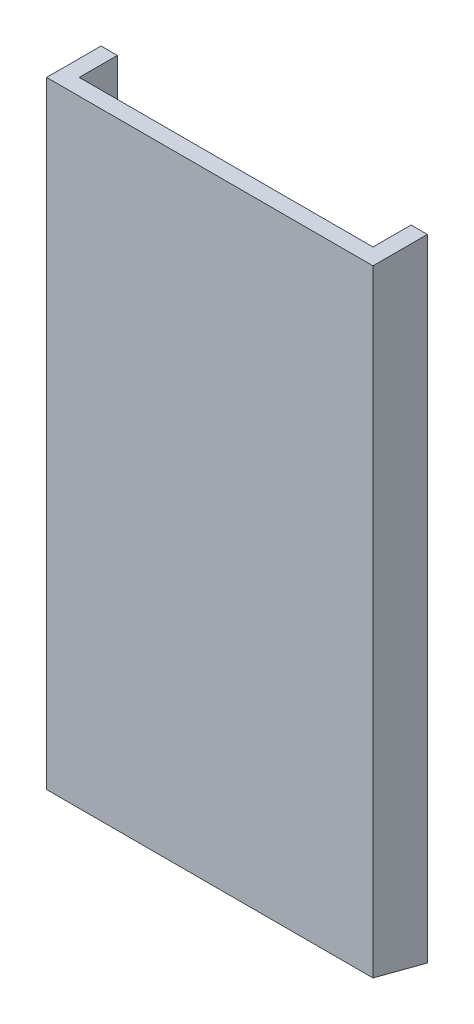
ISO-10303-21;
HEADER;
FILE_DESCRIPTION(('STEP AP214'),'2;1');
FILE_NAME('part.step','',(''),(''),'','','');
FILE_SCHEMA(('AUTOMOTIVE_DESIGN { 1 0 10303 214 1 1 1 1 }'));
ENDSEC;
DATA;
#1=APPLICATION_CONTEXT('core data for automotive mechanical design processes');
#2=APPLICATION_PROTOCOL_DEFINITION('international standard','automotive_design',2000,#1);
#3=PRODUCT_CONTEXT('',#1,'mechanical');
#4=PRODUCT('Part','Part','',(#3));
#5=PRODUCT_RELATED_PRODUCT_CATEGORY('part','',(#4));
#6=PRODUCT_DEFINITION_FORMATION('','',#4);
#7=PRODUCT_DEFINITION_CONTEXT('part definition',#1,'design');
#8=PRODUCT_DEFINITION('design','',#6,#7);
#9=PRODUCT_DEFINITION_SHAPE('','',#8);
#10=(LENGTH_UNIT() NAMED_UNIT(*) SI_UNIT(.MILLI.,.METRE.));
#11=(NAMED_UNIT(*) PLANE_ANGLE_UNIT() SI_UNIT($,.RADIAN.));
#12=(NAMED_UNIT(*) SI_UNIT($,.STERADIAN.) SOLID_ANGLE_UNIT());
#13=UNCERTAINTY_MEASURE_WITH_UNIT(LENGTH_MEASURE(1.E-05),#10,'distance_accuracy_value','');
#14=(GEOMETRIC_REPRESENTATION_CONTEXT(3) GLOBAL_UNCERTAINTY_ASSIGNED_CONTEXT((#13)) GLOBAL_UNIT_ASSIGNED_CONTEXT((#10,
#11,#12)) REPRESENTATION_CONTEXT('',''));
#15=CARTESIAN_POINT('',(0.,0.,0.));
#16=DIRECTION('',(0.,0.,1.));
#17=DIRECTION('',(1.,0.,0.));
#18=AXIS2_PLACEMENT_3D('',#15,#16,#17);
#19=CARTESIAN_POINT('',(-13.5,4.,-11.5));
#20=DIRECTION('',(-1.,0.,0.));
#21=DIRECTION('',(0.,0.,1.));
#22=AXIS2_PLACEMENT_3D('',#19,#20,#21);
#23=CYLINDRICAL_SURFACE('',#22,5.);
#24=CARTESIAN_POINT('',(-15.,4.,-11.5));
#25=DIRECTION('',(-1.,0.,0.));
#26=DIRECTION('',(0.,0.,1.));
#27=AXIS2_PLACEMENT_3D('',#24,#25,#26);
#28=CIRCLE('',#27,5.);
#29=CARTESIAN_POINT('',(-15.,8.63953921064893,-13.3640482592602));
#30=VERTEX_POINT('',#29);
#31=CARTESIAN_POINT('',(-15.,-1.,-11.5));
#32=VERTEX_POINT('',#31);
#33=EDGE_CURVE('E110',#30,#32,#28,.T.);
#34=ORIENTED_EDGE('',*,*,#33,.F.);
#35=DIRECTION('',(-1.,0.,0.));
#36=VECTOR('',#35,1.);
#37=CARTESIAN_POINT('',(-13.5,8.63953921064893,-13.3640482592602));
#38=LINE('',#37,#36);
#39=CARTESIAN_POINT('',(-13.5,8.63953921064893,-13.3640482592602));
#40=VERTEX_POINT('',#39);
#41=EDGE_CURVE('E12',#40,#30,#38,.T.);
#42=ORIENTED_EDGE('',*,*,#41,.F.);
#43=CARTESIAN_POINT('',(-13.5,4.,-11.5));
#44=DIRECTION('',(-1.,0.,0.));
#45=DIRECTION('',(0.,0.,1.));
#46=AXIS2_PLACEMENT_3D('',#43,#44,#45);
#47=CIRCLE('',#46,5.);
#48=CARTESIAN_POINT('',(-13.5,-1.,-11.5));
#49=VERTEX_POINT('',#48);
#50=EDGE_CURVE('E103',#40,#49,#47,.T.);
#51=ORIENTED_EDGE('',*,*,#50,.T.);
#52=DIRECTION('',(-1.,0.,0.));
#53=VECTOR('',#52,1.);
#54=CARTESIAN_POINT('',(-13.5,-1.,-11.5));
#55=LINE('',#54,#53);
#56=EDGE_CURVE('E48',#49,#32,#55,.T.);
#57=ORIENTED_EDGE('',*,*,#56,.T.);
#58=EDGE_LOOP('',(#34,#42,#51,#57));
#59=FACE_BOUND('',#58,.T.);
#60=ADVANCED_FACE('F45',(#59),#23,.T.);
#61=CARTESIAN_POINT('',(-13.5,12.,-5.));
#62=DIRECTION('',(0.,0.927907842129786,-0.372809651852045));
#63=DIRECTION('',(0.,0.372809651852045,0.927907842129787));
#64=AXIS2_PLACEMENT_3D('',#61,#62,#63);
#65=PLANE('',#64);
#66=DIRECTION('',(0.,-0.372809651852045,-0.927907842129787));
#67=VECTOR('',#66,1.);
#68=CARTESIAN_POINT('',(-15.,12.,-5.));
#69=LINE('',#68,#67);
#70=CARTESIAN_POINT('',(-15.,12.,-5.));
#71=VERTEX_POINT('',#70);
#72=EDGE_CURVE('E105',#71,#30,#69,.T.);
#73=ORIENTED_EDGE('',*,*,#72,.F.);
#74=DIRECTION('',(-1.,0.,0.));
#75=VECTOR('',#74,1.);
#76=CARTESIAN_POINT('',(-13.5,12.,-5.));
#77=LINE('',#76,#75);
#78=CARTESIAN_POINT('',(-13.5,12.,-5.));
#79=VERTEX_POINT('',#78);
#80=EDGE_CURVE('E54',#79,#71,#77,.T.);
#81=ORIENTED_EDGE('',*,*,#80,.F.);
#82=DIRECTION('',(0.,-0.372809651852045,-0.927907842129787));
#83=VECTOR('',#82,1.);
#84=CARTESIAN_POINT('',(-13.5,12.,-5.));
#85=LINE('',#84,#83);
#86=EDGE_CURVE('E100',#79,#40,#85,.T.);
#87=ORIENTED_EDGE('',*,*,#86,.T.);
#88=ORIENTED_EDGE('',*,*,#41,.T.);
#89=EDGE_LOOP('',(#73,#81,#87,#88));
#90=FACE_BOUND('',#89,.T.);
#91=ADVANCED_FACE('F121',(#90),#65,.T.);
#92=CARTESIAN_POINT('',(-13.5,12.,-5.));
#93=DIRECTION('',(0.,0.,1.));
#94=DIRECTION('',(0.,-1.,0.));
#95=AXIS2_PLACEMENT_3D('',#92,#93,#94);
#96=PLANE('',#95);
#97=DIRECTION('',(0.,1.,0.));
#98=VECTOR('',#97,1.);
#99=CARTESIAN_POINT('',(-15.,12.,-5.));
#100=LINE('',#99,#98);
#101=CARTESIAN_POINT('',(-15.,0.,-5.));
#102=VERTEX_POINT('',#101);
#103=EDGE_CURVE('E95',#102,#71,#100,.T.);
#104=ORIENTED_EDGE('',*,*,#103,.F.);
#105=DIRECTION('',(-1.,0.,0.));
#106=VECTOR('',#105,1.);
#107=CARTESIAN_POINT('',(-13.5,0.,-5.));
#108=LINE('',#107,#106);
#109=CARTESIAN_POINT('',(-13.5,0.,-5.));
#110=VERTEX_POINT('',#109);
#111=EDGE_CURVE('E90',#110,#102,#108,.T.);
#112=ORIENTED_EDGE('',*,*,#111,.F.);
#113=DIRECTION('',(0.,1.,0.));
#114=VECTOR('',#113,1.);
#115=CARTESIAN_POINT('',(-13.5,12.,-5.));
#116=LINE('',#115,#114);
#117=EDGE_CURVE('E93',#110,#79,#116,.T.);
#118=ORIENTED_EDGE('',*,*,#117,.T.);
#119=ORIENTED_EDGE('',*,*,#80,.T.);
#120=EDGE_LOOP('',(#104,#112,#118,#119));
#121=FACE_BOUND('',#120,.T.);
#122=ADVANCED_FACE('F92',(#121),#96,.T.);
#123=CARTESIAN_POINT('',(-13.5,-1.,-11.5));
#124=DIRECTION('',(0.,-0.988371697650617,0.152057184253941));
#125=DIRECTION('',(0.,-0.152057184253941,-0.988371697650617));
#126=AXIS2_PLACEMENT_3D('',#123,#124,#125);
#127=PLANE('',#126);
#128=DIRECTION('',(0.,0.152057184253941,0.988371697650617));
#129=VECTOR('',#128,1.);
#130=CARTESIAN_POINT('',(-15.,-1.,-11.5));
#131=LINE('',#130,#129);
#132=EDGE_CURVE('E113',#32,#102,#131,.T.);
#133=ORIENTED_EDGE('',*,*,#132,.F.);
#134=ORIENTED_EDGE('',*,*,#56,.F.);
#135=DIRECTION('',(0.,0.152057184253941,0.988371697650617));
#136=VECTOR('',#135,1.);
#137=CARTESIAN_POINT('',(-13.5,-1.,-11.5));
#138=LINE('',#137,#136);
#139=EDGE_CURVE('E99',#49,#110,#138,.T.);
#140=ORIENTED_EDGE('',*,*,#139,.T.);
#141=ORIENTED_EDGE('',*,*,#111,.T.);
#142=EDGE_LOOP('',(#133,#134,#140,#141));
#143=FACE_BOUND('',#142,.T.);
#144=ADVANCED_FACE('F102',(#143),#127,.T.);
#145=CARTESIAN_POINT('',(-13.5,4.,-11.5));
#146=DIRECTION('',(-1.,0.,0.));
#147=DIRECTION('',(0.,0.,1.));
#148=AXIS2_PLACEMENT_3D('',#145,#146,#147);
#149=PLANE('',#148);
#150=CARTESIAN_POINT('',(-13.5,4.,-11.5));
#151=DIRECTION('',(1.,0.,0.));
#152=DIRECTION('',(0.,0.,-1.));
#153=AXIS2_PLACEMENT_3D('',#150,#151,#152);
#154=CIRCLE('',#153,1.55);
#155=CARTESIAN_POINT('',(-13.5,4.,-13.05));
#156=VERTEX_POINT('',#155);
#157=EDGE_CURVE('E151',#156,#156,#154,.T.);
#158=ORIENTED_EDGE('',*,*,#157,.F.);
#159=EDGE_LOOP('',(#158));
#160=FACE_BOUND('',#159,.T.);
#161=ORIENTED_EDGE('',*,*,#50,.F.);
#162=ORIENTED_EDGE('',*,*,#86,.F.);
#163=ORIENTED_EDGE('',*,*,#117,.F.);
#164=ORIENTED_EDGE('',*,*,#139,.F.);
#165=EDGE_LOOP('',(#161,#162,#163,#164));
#166=FACE_BOUND('',#165,.T.);
#167=ADVANCED_FACE('F98',(#160,#166),#149,.F.);
#168=CARTESIAN_POINT('',(-15.,4.,-11.5));
#169=DIRECTION('',(-1.,0.,0.));
#170=DIRECTION('',(0.,0.,1.));
#171=AXIS2_PLACEMENT_3D('',#168,#169,#170);
#172=PLANE('',#171);
#173=CARTESIAN_POINT('',(-15.,4.,-11.5));
#174=DIRECTION('',(1.,0.,0.));
#175=DIRECTION('',(0.,0.,-1.));
#176=AXIS2_PLACEMENT_3D('',#173,#174,#175);
#177=CIRCLE('',#176,1.55);
#178=CARTESIAN_POINT('',(-15.,4.,-13.05));
#179=VERTEX_POINT('',#178);
#180=EDGE_CURVE('E114',#179,#179,#177,.T.);
#181=ORIENTED_EDGE('',*,*,#180,.T.);
#182=EDGE_LOOP('',(#181));
#183=FACE_BOUND('',#182,.T.);
#184=ORIENTED_EDGE('',*,*,#33,.T.);
#185=ORIENTED_EDGE('',*,*,#132,.T.);
#186=ORIENTED_EDGE('',*,*,#103,.T.);
#187=ORIENTED_EDGE('',*,*,#72,.T.);
#188=EDGE_LOOP('',(#184,#185,#186,#187));
#189=FACE_BOUND('',#188,.T.);
#190=ADVANCED_FACE('F120',(#183,#189),#172,.T.);
#191=CARTESIAN_POINT('',(-15.,4.,-11.5));
#192=DIRECTION('',(1.,0.,0.));
#193=DIRECTION('',(0.,0.,-1.));
#194=AXIS2_PLACEMENT_3D('',#191,#192,#193);
#195=CYLINDRICAL_SURFACE('',#194,1.55);
#196=ORIENTED_EDGE('',*,*,#180,.F.);
#197=EDGE_LOOP('',(#196));
#198=FACE_BOUND('',#197,.T.);
#199=ORIENTED_EDGE('',*,*,#157,.T.);
#200=EDGE_LOOP('',(#199));
#201=FACE_BOUND('',#200,.T.);
#202=ADVANCED_FACE('F139',(#198,#201),#195,.F.);
#203=CLOSED_SHELL('',(#60,#91,#122,#144,#167,#190,#202));
#204=MANIFOLD_SOLID_BREP('B2',#203);
#205=CARTESIAN_POINT('',(-15.,58.,-5.));
#206=DIRECTION('',(1.,0.,0.));
#207=DIRECTION('',(0.,0.,-1.));
#208=AXIS2_PLACEMENT_3D('',#205,#206,#207);
#209=PLANE('',#208);
#210=DIRECTION('',(0.,-1.,0.));
#211=VECTOR('',#210,1.);
#212=CARTESIAN_POINT('',(-15.,58.,-5.));
#213=LINE('',#212,#211);
#214=CARTESIAN_POINT('',(-15.,58.,-5.));
#215=VERTEX_POINT('',#214);
#216=CARTESIAN_POINT('',(-15.,0.,-5.));
#217=VERTEX_POINT('',#216);
#218=EDGE_CURVE('E287',#215,#217,#213,.T.);
#219=ORIENTED_EDGE('',*,*,#218,.T.);
#220=DIRECTION('',(0.,-0.252556606273089,-0.967582120870275));
#221=VECTOR('',#220,1.);
#222=CARTESIAN_POINT('',(-15.,0.,-5.));
#223=LINE('',#222,#221);
#224=CARTESIAN_POINT('',(-15.,1.30509132416549,0.));
#225=VERTEX_POINT('',#224);
#226=EDGE_CURVE('E261',#225,#217,#223,.T.);
#227=ORIENTED_EDGE('',*,*,#226,.F.);
#228=DIRECTION('',(0.,-1.,0.));
#229=VECTOR('',#228,1.);
#230=CARTESIAN_POINT('',(-15.,58.,0.));
#231=LINE('',#230,#229);
#232=CARTESIAN_POINT('',(-15.,58.,0.));
#233=VERTEX_POINT('',#232);
#234=EDGE_CURVE('E43',#233,#225,#231,.T.);
#235=ORIENTED_EDGE('',*,*,#234,.F.);
#236=DIRECTION('',(0.,0.,1.));
#237=VECTOR('',#236,1.);
#238=CARTESIAN_POINT('',(-15.,58.,-5.));
#239=LINE('',#238,#237);
#240=EDGE_CURVE('E293',#215,#233,#239,.T.);
#241=ORIENTED_EDGE('',*,*,#240,.F.);
#242=EDGE_LOOP('',(#219,#227,#235,#241));
#243=FACE_BOUND('',#242,.T.);
#244=ADVANCED_FACE('F190',(#243),#209,.F.);
#245=CARTESIAN_POINT('',(-15.,58.,0.));
#246=DIRECTION('',(0.,0.,-1.));
#247=DIRECTION('',(-1.,0.,0.));
#248=AXIS2_PLACEMENT_3D('',#245,#246,#247);
#249=PLANE('',#248);
#250=ORIENTED_EDGE('',*,*,#234,.T.);
#251=DIRECTION('',(-1.,0.,0.));
#252=VECTOR('',#251,1.);
#253=CARTESIAN_POINT('',(15.,1.30509132416549,0.));
#254=LINE('',#253,#252);
#255=CARTESIAN_POINT('',(15.,1.30509132416549,0.));
#256=VERTEX_POINT('',#255);
#257=EDGE_CURVE('E253',#256,#225,#254,.T.);
#258=ORIENTED_EDGE('',*,*,#257,.F.);
#259=DIRECTION('',(0.,-1.,0.));
#260=VECTOR('',#259,1.);
#261=CARTESIAN_POINT('',(15.,58.,0.));
#262=LINE('',#261,#260);
#263=CARTESIAN_POINT('',(15.,58.,0.));
#264=VERTEX_POINT('',#263);
#265=EDGE_CURVE('E198',#264,#256,#262,.T.);
#266=ORIENTED_EDGE('',*,*,#265,.F.);
#267=DIRECTION('',(1.,0.,0.));
#268=VECTOR('',#267,1.);
#269=CARTESIAN_POINT('',(-15.,58.,0.));
#270=LINE('',#269,#268);
#271=EDGE_CURVE('E306',#233,#264,#270,.T.);
#272=ORIENTED_EDGE('',*,*,#271,.F.);
#273=EDGE_LOOP('',(#250,#258,#266,#272));
#274=FACE_BOUND('',#273,.T.);
#275=ADVANCED_FACE('F265',(#274),#249,.F.);
#276=CARTESIAN_POINT('',(15.,58.,0.));
#277=DIRECTION('',(-1.,0.,0.));
#278=DIRECTION('',(0.,0.,1.));
#279=AXIS2_PLACEMENT_3D('',#276,#277,#278);
#280=PLANE('',#279);
#281=ORIENTED_EDGE('',*,*,#265,.T.);
#282=DIRECTION('',(0.,-0.252556606273089,-0.967582120870275));
#283=VECTOR('',#282,1.);
#284=CARTESIAN_POINT('',(15.,0.,-5.));
#285=LINE('',#284,#283);
#286=CARTESIAN_POINT('',(15.,0.,-5.));
#287=VERTEX_POINT('',#286);
#288=EDGE_CURVE('E249',#256,#287,#285,.T.);
#289=ORIENTED_EDGE('',*,*,#288,.T.);
#290=DIRECTION('',(0.,-1.,0.));
#291=VECTOR('',#290,1.);
#292=CARTESIAN_POINT('',(15.,58.,-5.));
#293=LINE('',#292,#291);
#294=CARTESIAN_POINT('',(15.,58.,-5.));
#295=VERTEX_POINT('',#294);
#296=EDGE_CURVE('E272',#295,#287,#293,.T.);
#297=ORIENTED_EDGE('',*,*,#296,.F.);
#298=DIRECTION('',(0.,0.,-1.));
#299=VECTOR('',#298,1.);
#300=CARTESIAN_POINT('',(15.,58.,0.));
#301=LINE('',#300,#299);
#302=EDGE_CURVE('E271',#264,#295,#301,.T.);
#303=ORIENTED_EDGE('',*,*,#302,.F.);
#304=EDGE_LOOP('',(#281,#289,#297,#303));
#305=FACE_BOUND('',#304,.T.);
#306=ADVANCED_FACE('F270',(#305),#280,.F.);
#307=CARTESIAN_POINT('',(13.5,58.,-5.));
#308=DIRECTION('',(0.,0.,1.));
#309=DIRECTION('',(1.,0.,0.));
#310=AXIS2_PLACEMENT_3D('',#307,#308,#309);
#311=PLANE('',#310);
#312=DIRECTION('',(-1.,0.,0.));
#313=VECTOR('',#312,1.);
#314=CARTESIAN_POINT('',(13.5,0.,-5.));
#315=LINE('',#314,#313);
#316=CARTESIAN_POINT('',(13.5,0.,-5.));
#317=VERTEX_POINT('',#316);
#318=EDGE_CURVE('E256',#287,#317,#315,.T.);
#319=ORIENTED_EDGE('',*,*,#318,.T.);
#320=DIRECTION('',(0.,-1.,0.));
#321=VECTOR('',#320,1.);
#322=CARTESIAN_POINT('',(13.5,58.,-5.));
#323=LINE('',#322,#321);
#324=CARTESIAN_POINT('',(13.5,58.,-5.));
#325=VERTEX_POINT('',#324);
#326=EDGE_CURVE('E273',#325,#317,#323,.T.);
#327=ORIENTED_EDGE('',*,*,#326,.F.);
#328=DIRECTION('',(-1.,0.,0.));
#329=VECTOR('',#328,1.);
#330=CARTESIAN_POINT('',(13.5,58.,-5.));
#331=LINE('',#330,#329);
#332=EDGE_CURVE('E303',#295,#325,#331,.T.);
#333=ORIENTED_EDGE('',*,*,#332,.F.);
#334=ORIENTED_EDGE('',*,*,#296,.T.);
#335=EDGE_LOOP('',(#319,#327,#333,#334));
#336=FACE_BOUND('',#335,.T.);
#337=ADVANCED_FACE('F325',(#336),#311,.F.);
#338=CARTESIAN_POINT('',(13.5,58.,-5.));
#339=DIRECTION('',(1.,0.,0.));
#340=DIRECTION('',(0.,0.,-1.));
#341=AXIS2_PLACEMENT_3D('',#338,#339,#340);
#342=PLANE('',#341);
#343=ORIENTED_EDGE('',*,*,#326,.T.);
#344=DIRECTION('',(0.,0.252556606273089,0.967582120870275));
#345=VECTOR('',#344,1.);
#346=CARTESIAN_POINT('',(13.5,3.69952068358645,9.17341689077584));
#347=LINE('',#346,#345);
#348=CARTESIAN_POINT('',(13.5,0.913563926915842,-1.5));
#349=VERTEX_POINT('',#348);
#350=EDGE_CURVE('E295',#317,#349,#347,.T.);
#351=ORIENTED_EDGE('',*,*,#350,.T.);
#352=DIRECTION('',(0.,-1.,0.));
#353=VECTOR('',#352,1.);
#354=CARTESIAN_POINT('',(13.5,58.,-1.5));
#355=LINE('',#354,#353);
#356=CARTESIAN_POINT('',(13.5,58.,-1.5));
#357=VERTEX_POINT('',#356);
#358=EDGE_CURVE('E278',#357,#349,#355,.T.);
#359=ORIENTED_EDGE('',*,*,#358,.F.);
#360=DIRECTION('',(0.,0.,1.));
#361=VECTOR('',#360,1.);
#362=CARTESIAN_POINT('',(13.5,58.,-5.));
#363=LINE('',#362,#361);
#364=EDGE_CURVE('E301',#325,#357,#363,.T.);
#365=ORIENTED_EDGE('',*,*,#364,.F.);
#366=EDGE_LOOP('',(#343,#351,#359,#365));
#367=FACE_BOUND('',#366,.T.);
#368=ADVANCED_FACE('F329',(#367),#342,.F.);
#369=CARTESIAN_POINT('',(13.5,58.,-1.5));
#370=DIRECTION('',(0.,0.,1.));
#371=DIRECTION('',(1.,0.,0.));
#372=AXIS2_PLACEMENT_3D('',#369,#370,#371);
#373=PLANE('',#372);
#374=ORIENTED_EDGE('',*,*,#358,.T.);
#375=DIRECTION('',(-1.,0.,0.));
#376=VECTOR('',#375,1.);
#377=CARTESIAN_POINT('',(13.5,0.913563926915842,-1.5));
#378=LINE('',#377,#376);
#379=CARTESIAN_POINT('',(-13.5,0.913563926915851,-1.5));
#380=VERTEX_POINT('',#379);
#381=EDGE_CURVE('E311',#349,#380,#378,.T.);
#382=ORIENTED_EDGE('',*,*,#381,.T.);
#383=DIRECTION('',(0.,-1.,0.));
#384=VECTOR('',#383,1.);
#385=CARTESIAN_POINT('',(-13.5,58.,-1.5));
#386=LINE('',#385,#384);
#387=CARTESIAN_POINT('',(-13.5,58.,-1.5));
#388=VERTEX_POINT('',#387);
#389=EDGE_CURVE('E281',#388,#380,#386,.T.);
#390=ORIENTED_EDGE('',*,*,#389,.F.);
#391=DIRECTION('',(-1.,0.,0.));
#392=VECTOR('',#391,1.);
#393=CARTESIAN_POINT('',(13.5,58.,-1.5));
#394=LINE('',#393,#392);
#395=EDGE_CURVE('E299',#357,#388,#394,.T.);
#396=ORIENTED_EDGE('',*,*,#395,.F.);
#397=EDGE_LOOP('',(#374,#382,#390,#396));
#398=FACE_BOUND('',#397,.T.);
#399=ADVANCED_FACE('F334',(#398),#373,.F.);
#400=CARTESIAN_POINT('',(-13.5,58.,-1.5));
#401=DIRECTION('',(-1.,0.,0.));
#402=DIRECTION('',(0.,0.,1.));
#403=AXIS2_PLACEMENT_3D('',#400,#401,#402);
#404=PLANE('',#403);
#405=ORIENTED_EDGE('',*,*,#389,.T.);
#406=DIRECTION('',(0.,-0.252556606273089,-0.967582120870275));
#407=VECTOR('',#406,1.);
#408=CARTESIAN_POINT('',(-13.5,4.55481308216775,12.4501699529732));
#409=LINE('',#408,#407);
#410=CARTESIAN_POINT('',(-13.5,0.,-5.));
#411=VERTEX_POINT('',#410);
#412=EDGE_CURVE('E268',#380,#411,#409,.T.);
#413=ORIENTED_EDGE('',*,*,#412,.T.);
#414=DIRECTION('',(0.,-1.,0.));
#415=VECTOR('',#414,1.);
#416=CARTESIAN_POINT('',(-13.5,58.,-5.));
#417=LINE('',#416,#415);
#418=CARTESIAN_POINT('',(-13.5,58.,-5.));
#419=VERTEX_POINT('',#418);
#420=EDGE_CURVE('E284',#419,#411,#417,.T.);
#421=ORIENTED_EDGE('',*,*,#420,.F.);
#422=DIRECTION('',(0.,0.,-1.));
#423=VECTOR('',#422,1.);
#424=CARTESIAN_POINT('',(-13.5,58.,-1.5));
#425=LINE('',#424,#423);
#426=EDGE_CURVE('E297',#388,#419,#425,.T.);
#427=ORIENTED_EDGE('',*,*,#426,.F.);
#428=EDGE_LOOP('',(#405,#413,#421,#427));
#429=FACE_BOUND('',#428,.T.);
#430=ADVANCED_FACE('F336',(#429),#404,.F.);
#431=CARTESIAN_POINT('',(-13.5,58.,-5.));
#432=DIRECTION('',(0.,0.,1.));
#433=DIRECTION('',(1.,0.,0.));
#434=AXIS2_PLACEMENT_3D('',#431,#432,#433);
#435=PLANE('',#434);
#436=DIRECTION('',(-1.,0.,0.));
#437=VECTOR('',#436,1.);
#438=CARTESIAN_POINT('',(-13.5,0.,-5.));
#439=LINE('',#438,#437);
#440=EDGE_CURVE('E290',#411,#217,#439,.T.);
#441=ORIENTED_EDGE('',*,*,#440,.T.);
#442=ORIENTED_EDGE('',*,*,#218,.F.);
#443=DIRECTION('',(-1.,0.,0.));
#444=VECTOR('',#443,1.);
#445=CARTESIAN_POINT('',(-13.5,58.,-5.));
#446=LINE('',#445,#444);
#447=EDGE_CURVE('E205',#419,#215,#446,.T.);
#448=ORIENTED_EDGE('',*,*,#447,.F.);
#449=ORIENTED_EDGE('',*,*,#420,.T.);
#450=EDGE_LOOP('',(#441,#442,#448,#449));
#451=FACE_BOUND('',#450,.T.);
#452=ADVANCED_FACE('F318',(#451),#435,.F.);
#453=CARTESIAN_POINT('',(0.,58.,0.));
#454=DIRECTION('',(0.,1.,0.));
#455=DIRECTION('',(0.,0.,1.));
#456=AXIS2_PLACEMENT_3D('',#453,#454,#455);
#457=PLANE('',#456);
#458=ORIENTED_EDGE('',*,*,#240,.T.);
#459=ORIENTED_EDGE('',*,*,#271,.T.);
#460=ORIENTED_EDGE('',*,*,#302,.T.);
#461=ORIENTED_EDGE('',*,*,#332,.T.);
#462=ORIENTED_EDGE('',*,*,#364,.T.);
#463=ORIENTED_EDGE('',*,*,#395,.T.);
#464=ORIENTED_EDGE('',*,*,#426,.T.);
#465=ORIENTED_EDGE('',*,*,#447,.T.);
#466=EDGE_LOOP('',(#458,#459,#460,#461,#462,#463,#464,#465));
#467=FACE_BOUND('',#466,.T.);
#468=ADVANCED_FACE('F321',(#467),#457,.T.);
#469=CARTESIAN_POINT('',(15.,0.,-5.));
#470=DIRECTION('',(0.,0.967582120870275,-0.252556606273089));
#471=DIRECTION('',(0.,0.252556606273089,0.967582120870275));
#472=AXIS2_PLACEMENT_3D('',#469,#470,#471);
#473=PLANE('',#472);
#474=ORIENTED_EDGE('',*,*,#318,.F.);
#475=ORIENTED_EDGE('',*,*,#288,.F.);
#476=ORIENTED_EDGE('',*,*,#257,.T.);
#477=ORIENTED_EDGE('',*,*,#226,.T.);
#478=ORIENTED_EDGE('',*,*,#440,.F.);
#479=ORIENTED_EDGE('',*,*,#412,.F.);
#480=ORIENTED_EDGE('',*,*,#381,.F.);
#481=ORIENTED_EDGE('',*,*,#350,.F.);
#482=EDGE_LOOP('',(#474,#475,#476,#477,#478,#479,#480,#481));
#483=FACE_BOUND('',#482,.T.);
#484=ADVANCED_FACE('F251',(#483),#473,.F.);
#485=CLOSED_SHELL('',(#244,#275,#306,#337,#368,#399,#430,#452,#468,#484));
#486=MANIFOLD_SOLID_BREP('B6',#485);
#487=ADVANCED_BREP_SHAPE_REPRESENTATION('',(#18,#204,#486),#14);
#488=SHAPE_DEFINITION_REPRESENTATION(#9,#487);
ENDSEC;
END-ISO-10303-21;
